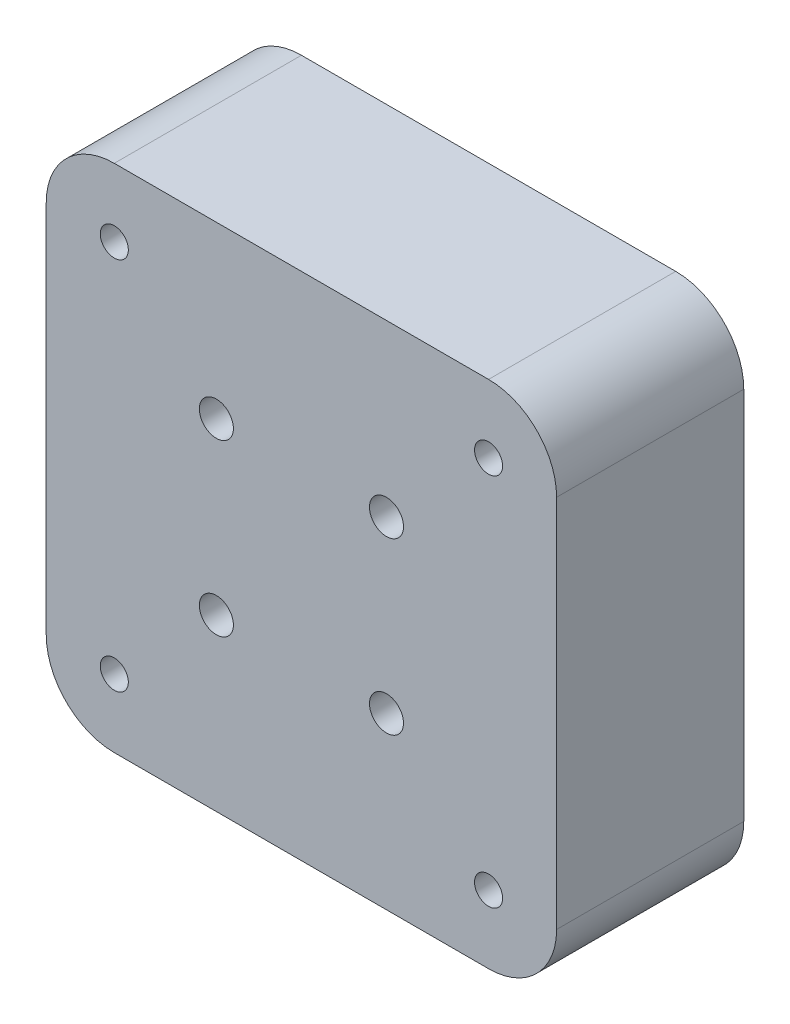
ISO-10303-21;
HEADER;
FILE_DESCRIPTION(('STEP AP214'),'2;1');
FILE_NAME('part.step','',(''),(''),'','','');
FILE_SCHEMA(('AUTOMOTIVE_DESIGN { 1 0 10303 214 1 1 1 1 }'));
ENDSEC;
DATA;
#1=APPLICATION_CONTEXT('core data for automotive mechanical design processes');
#2=APPLICATION_PROTOCOL_DEFINITION('international standard','automotive_design',2000,#1);
#3=PRODUCT_CONTEXT('',#1,'mechanical');
#4=PRODUCT('Part','Part','',(#3));
#5=PRODUCT_RELATED_PRODUCT_CATEGORY('part','',(#4));
#6=PRODUCT_DEFINITION_FORMATION('','',#4);
#7=PRODUCT_DEFINITION_CONTEXT('part definition',#1,'design');
#8=PRODUCT_DEFINITION('design','',#6,#7);
#9=PRODUCT_DEFINITION_SHAPE('','',#8);
#10=(LENGTH_UNIT() NAMED_UNIT(*) SI_UNIT(.MILLI.,.METRE.));
#11=(NAMED_UNIT(*) PLANE_ANGLE_UNIT() SI_UNIT($,.RADIAN.));
#12=(NAMED_UNIT(*) SI_UNIT($,.STERADIAN.) SOLID_ANGLE_UNIT());
#13=UNCERTAINTY_MEASURE_WITH_UNIT(LENGTH_MEASURE(1.E-05),#10,'distance_accuracy_value','');
#14=(GEOMETRIC_REPRESENTATION_CONTEXT(3) GLOBAL_UNCERTAINTY_ASSIGNED_CONTEXT((#13)) GLOBAL_UNIT_ASSIGNED_CONTEXT((#10,
#11,#12)) REPRESENTATION_CONTEXT('',''));
#15=CARTESIAN_POINT('',(0.,0.,0.));
#16=DIRECTION('',(0.,0.,1.));
#17=DIRECTION('',(1.,0.,0.));
#18=AXIS2_PLACEMENT_3D('',#15,#16,#17);
#19=CARTESIAN_POINT('',(30.,30.,22.));
#20=DIRECTION('',(-1.,0.,0.));
#21=DIRECTION('',(0.,0.,1.));
#22=AXIS2_PLACEMENT_3D('',#19,#20,#21);
#23=PLANE('',#22);
#24=DIRECTION('',(0.,1.,0.));
#25=VECTOR('',#24,1.);
#26=CARTESIAN_POINT('',(30.,30.,22.));
#27=LINE('',#26,#25);
#28=CARTESIAN_POINT('',(30.,-22.,22.));
#29=VERTEX_POINT('',#28);
#30=CARTESIAN_POINT('',(30.,22.,22.));
#31=VERTEX_POINT('',#30);
#32=EDGE_CURVE('E263',#29,#31,#27,.T.);
#33=ORIENTED_EDGE('',*,*,#32,.F.);
#34=DIRECTION('',(0.,0.,-1.));
#35=VECTOR('',#34,1.);
#36=CARTESIAN_POINT('',(30.,-22.,22.));
#37=LINE('',#36,#35);
#38=CARTESIAN_POINT('',(30.,-22.,0.));
#39=VERTEX_POINT('',#38);
#40=EDGE_CURVE('E286',#29,#39,#37,.T.);
#41=ORIENTED_EDGE('',*,*,#40,.T.);
#42=DIRECTION('',(0.,1.,0.));
#43=VECTOR('',#42,1.);
#44=CARTESIAN_POINT('',(30.,30.,0.));
#45=LINE('',#44,#43);
#46=CARTESIAN_POINT('',(30.,22.,0.));
#47=VERTEX_POINT('',#46);
#48=EDGE_CURVE('E262',#39,#47,#45,.T.);
#49=ORIENTED_EDGE('',*,*,#48,.T.);
#50=DIRECTION('',(0.,0.,-1.));
#51=VECTOR('',#50,1.);
#52=CARTESIAN_POINT('',(30.,22.,22.));
#53=LINE('',#52,#51);
#54=EDGE_CURVE('E275',#47,#31,#53,.F.);
#55=ORIENTED_EDGE('',*,*,#54,.T.);
#56=EDGE_LOOP('',(#33,#41,#49,#55));
#57=FACE_BOUND('',#56,.T.);
#58=ADVANCED_FACE('F47',(#57),#23,.F.);
#59=CARTESIAN_POINT('',(-30.,30.,22.));
#60=DIRECTION('',(0.,-1.,0.));
#61=DIRECTION('',(0.,0.,-1.));
#62=AXIS2_PLACEMENT_3D('',#59,#60,#61);
#63=PLANE('',#62);
#64=DIRECTION('',(-1.,0.,0.));
#65=VECTOR('',#64,1.);
#66=CARTESIAN_POINT('',(-30.,30.,22.));
#67=LINE('',#66,#65);
#68=CARTESIAN_POINT('',(21.9999999999999,30.,22.));
#69=VERTEX_POINT('',#68);
#70=CARTESIAN_POINT('',(-22.,30.,22.));
#71=VERTEX_POINT('',#70);
#72=EDGE_CURVE('E266',#69,#71,#67,.T.);
#73=ORIENTED_EDGE('',*,*,#72,.F.);
#74=DIRECTION('',(0.,0.,-1.));
#75=VECTOR('',#74,1.);
#76=CARTESIAN_POINT('',(22.,30.,22.));
#77=LINE('',#76,#75);
#78=CARTESIAN_POINT('',(22.,30.,0.));
#79=VERTEX_POINT('',#78);
#80=EDGE_CURVE('E13',#69,#79,#77,.T.);
#81=ORIENTED_EDGE('',*,*,#80,.T.);
#82=DIRECTION('',(-1.,0.,0.));
#83=VECTOR('',#82,1.);
#84=CARTESIAN_POINT('',(-30.,30.,0.));
#85=LINE('',#84,#83);
#86=CARTESIAN_POINT('',(-22.,30.,0.));
#87=VERTEX_POINT('',#86);
#88=EDGE_CURVE('E278',#79,#87,#85,.T.);
#89=ORIENTED_EDGE('',*,*,#88,.T.);
#90=DIRECTION('',(0.,0.,-1.));
#91=VECTOR('',#90,1.);
#92=CARTESIAN_POINT('',(-22.,30.,22.));
#93=LINE('',#92,#91);
#94=EDGE_CURVE('E56',#87,#71,#93,.F.);
#95=ORIENTED_EDGE('',*,*,#94,.T.);
#96=EDGE_LOOP('',(#73,#81,#89,#95));
#97=FACE_BOUND('',#96,.T.);
#98=ADVANCED_FACE('F380',(#97),#63,.F.);
#99=CARTESIAN_POINT('',(-30.,30.,22.));
#100=DIRECTION('',(1.,0.,0.));
#101=DIRECTION('',(0.,0.,-1.));
#102=AXIS2_PLACEMENT_3D('',#99,#100,#101);
#103=PLANE('',#102);
#104=DIRECTION('',(0.,-1.,0.));
#105=VECTOR('',#104,1.);
#106=CARTESIAN_POINT('',(-30.,30.,0.));
#107=LINE('',#106,#105);
#108=CARTESIAN_POINT('',(-30.,22.,0.));
#109=VERTEX_POINT('',#108);
#110=CARTESIAN_POINT('',(-30.,-22.,0.));
#111=VERTEX_POINT('',#110);
#112=EDGE_CURVE('E281',#109,#111,#107,.T.);
#113=ORIENTED_EDGE('',*,*,#112,.T.);
#114=DIRECTION('',(0.,0.,-1.));
#115=VECTOR('',#114,1.);
#116=CARTESIAN_POINT('',(-30.,-22.,22.));
#117=LINE('',#116,#115);
#118=CARTESIAN_POINT('',(-30.,-22.,22.));
#119=VERTEX_POINT('',#118);
#120=EDGE_CURVE('E72',#111,#119,#117,.F.);
#121=ORIENTED_EDGE('',*,*,#120,.T.);
#122=DIRECTION('',(0.,-1.,0.));
#123=VECTOR('',#122,1.);
#124=CARTESIAN_POINT('',(-30.,30.,22.));
#125=LINE('',#124,#123);
#126=CARTESIAN_POINT('',(-30.,22.,22.));
#127=VERTEX_POINT('',#126);
#128=EDGE_CURVE('E270',#127,#119,#125,.T.);
#129=ORIENTED_EDGE('',*,*,#128,.F.);
#130=DIRECTION('',(0.,0.,-1.));
#131=VECTOR('',#130,1.);
#132=CARTESIAN_POINT('',(-30.,22.,22.));
#133=LINE('',#132,#131);
#134=EDGE_CURVE('E310',#127,#109,#133,.T.);
#135=ORIENTED_EDGE('',*,*,#134,.T.);
#136=EDGE_LOOP('',(#113,#121,#129,#135));
#137=FACE_BOUND('',#136,.T.);
#138=ADVANCED_FACE('F386',(#137),#103,.F.);
#139=CARTESIAN_POINT('',(-30.,-30.,22.));
#140=DIRECTION('',(0.,1.,0.));
#141=DIRECTION('',(0.,0.,1.));
#142=AXIS2_PLACEMENT_3D('',#139,#140,#141);
#143=PLANE('',#142);
#144=DIRECTION('',(1.,0.,0.));
#145=VECTOR('',#144,1.);
#146=CARTESIAN_POINT('',(-30.,-30.,0.));
#147=LINE('',#146,#145);
#148=CARTESIAN_POINT('',(-22.,-30.,0.));
#149=VERTEX_POINT('',#148);
#150=CARTESIAN_POINT('',(22.,-30.,0.));
#151=VERTEX_POINT('',#150);
#152=EDGE_CURVE('E267',#149,#151,#147,.T.);
#153=ORIENTED_EDGE('',*,*,#152,.T.);
#154=DIRECTION('',(0.,0.,-1.));
#155=VECTOR('',#154,1.);
#156=CARTESIAN_POINT('',(22.,-30.,22.));
#157=LINE('',#156,#155);
#158=CARTESIAN_POINT('',(22.,-30.,22.));
#159=VERTEX_POINT('',#158);
#160=EDGE_CURVE('E300',#151,#159,#157,.F.);
#161=ORIENTED_EDGE('',*,*,#160,.T.);
#162=DIRECTION('',(1.,0.,0.));
#163=VECTOR('',#162,1.);
#164=CARTESIAN_POINT('',(-30.,-30.,22.));
#165=LINE('',#164,#163);
#166=CARTESIAN_POINT('',(-22.,-30.,22.));
#167=VERTEX_POINT('',#166);
#168=EDGE_CURVE('E272',#167,#159,#165,.T.);
#169=ORIENTED_EDGE('',*,*,#168,.F.);
#170=DIRECTION('',(0.,0.,-1.));
#171=VECTOR('',#170,1.);
#172=CARTESIAN_POINT('',(-22.,-30.,22.));
#173=LINE('',#172,#171);
#174=EDGE_CURVE('E297',#167,#149,#173,.T.);
#175=ORIENTED_EDGE('',*,*,#174,.T.);
#176=EDGE_LOOP('',(#153,#161,#169,#175));
#177=FACE_BOUND('',#176,.T.);
#178=ADVANCED_FACE('F342',(#177),#143,.F.);
#179=CARTESIAN_POINT('',(0.,0.,22.));
#180=DIRECTION('',(0.,0.,1.));
#181=DIRECTION('',(1.,0.,0.));
#182=AXIS2_PLACEMENT_3D('',#179,#180,#181);
#183=PLANE('',#182);
#184=CARTESIAN_POINT('',(-10.,-10.,22.));
#185=DIRECTION('',(0.,0.,1.));
#186=DIRECTION('',(1.,0.,0.));
#187=AXIS2_PLACEMENT_3D('',#184,#185,#186);
#188=CIRCLE('',#187,2.);
#189=CARTESIAN_POINT('',(-8.00000000000001,-10.,22.));
#190=VERTEX_POINT('',#189);
#191=EDGE_CURVE('E331',#190,#190,#188,.T.);
#192=ORIENTED_EDGE('',*,*,#191,.F.);
#193=EDGE_LOOP('',(#192));
#194=FACE_BOUND('',#193,.T.);
#195=CARTESIAN_POINT('',(10.,-10.,22.));
#196=DIRECTION('',(0.,0.,1.));
#197=DIRECTION('',(1.,0.,0.));
#198=AXIS2_PLACEMENT_3D('',#195,#196,#197);
#199=CIRCLE('',#198,2.);
#200=CARTESIAN_POINT('',(12.,-10.,22.));
#201=VERTEX_POINT('',#200);
#202=EDGE_CURVE('E322',#201,#201,#199,.T.);
#203=ORIENTED_EDGE('',*,*,#202,.F.);
#204=EDGE_LOOP('',(#203));
#205=FACE_BOUND('',#204,.T.);
#206=CARTESIAN_POINT('',(9.99999999999998,9.99999999999999,22.));
#207=DIRECTION('',(0.,0.,1.));
#208=DIRECTION('',(1.,0.,0.));
#209=AXIS2_PLACEMENT_3D('',#206,#207,#208);
#210=CIRCLE('',#209,2.);
#211=CARTESIAN_POINT('',(12.,9.99999999999999,22.));
#212=VERTEX_POINT('',#211);
#213=EDGE_CURVE('E319',#212,#212,#210,.T.);
#214=ORIENTED_EDGE('',*,*,#213,.F.);
#215=EDGE_LOOP('',(#214));
#216=FACE_BOUND('',#215,.T.);
#217=CARTESIAN_POINT('',(-10.,9.99999999999999,22.));
#218=DIRECTION('',(0.,0.,1.));
#219=DIRECTION('',(1.,0.,0.));
#220=AXIS2_PLACEMENT_3D('',#217,#218,#219);
#221=CIRCLE('',#220,2.);
#222=CARTESIAN_POINT('',(-8.00000000000001,9.99999999999999,22.));
#223=VERTEX_POINT('',#222);
#224=EDGE_CURVE('E191',#223,#223,#221,.T.);
#225=ORIENTED_EDGE('',*,*,#224,.F.);
#226=EDGE_LOOP('',(#225));
#227=FACE_BOUND('',#226,.T.);
#228=CARTESIAN_POINT('',(22.,22.,22.));
#229=DIRECTION('',(0.,0.,-1.));
#230=DIRECTION('',(-1.,0.,0.));
#231=AXIS2_PLACEMENT_3D('',#228,#229,#230);
#232=CIRCLE('',#231,1.65);
#233=CARTESIAN_POINT('',(20.35,22.,22.));
#234=VERTEX_POINT('',#233);
#235=EDGE_CURVE('E241',#234,#234,#232,.T.);
#236=ORIENTED_EDGE('',*,*,#235,.T.);
#237=EDGE_LOOP('',(#236));
#238=FACE_BOUND('',#237,.T.);
#239=CARTESIAN_POINT('',(-22.,22.,22.));
#240=DIRECTION('',(0.,0.,-1.));
#241=DIRECTION('',(-1.,0.,0.));
#242=AXIS2_PLACEMENT_3D('',#239,#240,#241);
#243=CIRCLE('',#242,1.65);
#244=CARTESIAN_POINT('',(-23.65,22.,22.));
#245=VERTEX_POINT('',#244);
#246=EDGE_CURVE('E247',#245,#245,#243,.T.);
#247=ORIENTED_EDGE('',*,*,#246,.T.);
#248=EDGE_LOOP('',(#247));
#249=FACE_BOUND('',#248,.T.);
#250=CARTESIAN_POINT('',(-22.,-22.,22.));
#251=DIRECTION('',(0.,0.,-1.));
#252=DIRECTION('',(-1.,0.,0.));
#253=AXIS2_PLACEMENT_3D('',#250,#251,#252);
#254=CIRCLE('',#253,1.65);
#255=CARTESIAN_POINT('',(-23.65,-22.,22.));
#256=VERTEX_POINT('',#255);
#257=EDGE_CURVE('E253',#256,#256,#254,.T.);
#258=ORIENTED_EDGE('',*,*,#257,.T.);
#259=EDGE_LOOP('',(#258));
#260=FACE_BOUND('',#259,.T.);
#261=CARTESIAN_POINT('',(22.,-22.,22.));
#262=DIRECTION('',(0.,0.,-1.));
#263=DIRECTION('',(-1.,0.,0.));
#264=AXIS2_PLACEMENT_3D('',#261,#262,#263);
#265=CIRCLE('',#264,1.65);
#266=CARTESIAN_POINT('',(20.35,-22.,22.));
#267=VERTEX_POINT('',#266);
#268=EDGE_CURVE('E259',#267,#267,#265,.T.);
#269=ORIENTED_EDGE('',*,*,#268,.T.);
#270=EDGE_LOOP('',(#269));
#271=FACE_BOUND('',#270,.T.);
#272=ORIENTED_EDGE('',*,*,#168,.T.);
#273=CARTESIAN_POINT('',(22.,-22.,22.));
#274=DIRECTION('',(0.,0.,1.));
#275=DIRECTION('',(1.,0.,0.));
#276=AXIS2_PLACEMENT_3D('',#273,#274,#275);
#277=CIRCLE('',#276,8.);
#278=EDGE_CURVE('E308',#159,#29,#277,.T.);
#279=ORIENTED_EDGE('',*,*,#278,.T.);
#280=ORIENTED_EDGE('',*,*,#32,.T.);
#281=CARTESIAN_POINT('',(22.,22.,22.));
#282=DIRECTION('',(0.,0.,1.));
#283=DIRECTION('',(1.,0.,0.));
#284=AXIS2_PLACEMENT_3D('',#281,#282,#283);
#285=CIRCLE('',#284,8.);
#286=EDGE_CURVE('E304',#31,#69,#285,.T.);
#287=ORIENTED_EDGE('',*,*,#286,.T.);
#288=ORIENTED_EDGE('',*,*,#72,.T.);
#289=CARTESIAN_POINT('',(-22.,22.,22.));
#290=DIRECTION('',(0.,0.,1.));
#291=DIRECTION('',(1.,0.,0.));
#292=AXIS2_PLACEMENT_3D('',#289,#290,#291);
#293=CIRCLE('',#292,8.);
#294=EDGE_CURVE('E302',#71,#127,#293,.T.);
#295=ORIENTED_EDGE('',*,*,#294,.T.);
#296=ORIENTED_EDGE('',*,*,#128,.T.);
#297=CARTESIAN_POINT('',(-22.,-22.,22.));
#298=DIRECTION('',(0.,0.,1.));
#299=DIRECTION('',(1.,0.,0.));
#300=AXIS2_PLACEMENT_3D('',#297,#298,#299);
#301=CIRCLE('',#300,8.);
#302=EDGE_CURVE('E306',#119,#167,#301,.T.);
#303=ORIENTED_EDGE('',*,*,#302,.T.);
#304=EDGE_LOOP('',(#272,#279,#280,#287,#288,#295,#296,#303));
#305=FACE_BOUND('',#304,.T.);
#306=ADVANCED_FACE('F338',(#194,#205,#216,#227,#238,#249,#260,#271,#305),#183,.T.);
#307=CARTESIAN_POINT('',(0.,0.,0.));
#308=DIRECTION('',(0.,0.,1.));
#309=DIRECTION('',(1.,0.,0.));
#310=AXIS2_PLACEMENT_3D('',#307,#308,#309);
#311=PLANE('',#310);
#312=DIRECTION('',(-1.,0.,0.));
#313=VECTOR('',#312,1.);
#314=CARTESIAN_POINT('',(15.,-20.,0.));
#315=LINE('',#314,#313);
#316=CARTESIAN_POINT('',(15.,-20.,0.));
#317=VERTEX_POINT('',#316);
#318=CARTESIAN_POINT('',(-15.,-20.,0.));
#319=VERTEX_POINT('',#318);
#320=EDGE_CURVE('E208',#317,#319,#315,.T.);
#321=ORIENTED_EDGE('',*,*,#320,.F.);
#322=CARTESIAN_POINT('',(15.,-15.,0.));
#323=DIRECTION('',(0.,0.,-1.));
#324=DIRECTION('',(-1.,0.,0.));
#325=AXIS2_PLACEMENT_3D('',#322,#323,#324);
#326=CIRCLE('',#325,5.);
#327=CARTESIAN_POINT('',(20.,-15.,0.));
#328=VERTEX_POINT('',#327);
#329=EDGE_CURVE('E64',#328,#317,#326,.T.);
#330=ORIENTED_EDGE('',*,*,#329,.F.);
#331=DIRECTION('',(0.,-1.,0.));
#332=VECTOR('',#331,1.);
#333=CARTESIAN_POINT('',(20.,15.,0.));
#334=LINE('',#333,#332);
#335=CARTESIAN_POINT('',(20.,15.,0.));
#336=VERTEX_POINT('',#335);
#337=EDGE_CURVE('E185',#336,#328,#334,.T.);
#338=ORIENTED_EDGE('',*,*,#337,.F.);
#339=CARTESIAN_POINT('',(15.,15.,0.));
#340=DIRECTION('',(0.,0.,-1.));
#341=DIRECTION('',(-1.,0.,0.));
#342=AXIS2_PLACEMENT_3D('',#339,#340,#341);
#343=CIRCLE('',#342,5.);
#344=CARTESIAN_POINT('',(15.,20.,0.));
#345=VERTEX_POINT('',#344);
#346=EDGE_CURVE('E188',#345,#336,#343,.T.);
#347=ORIENTED_EDGE('',*,*,#346,.F.);
#348=DIRECTION('',(1.,0.,0.));
#349=VECTOR('',#348,1.);
#350=CARTESIAN_POINT('',(15.,20.,0.));
#351=LINE('',#350,#349);
#352=CARTESIAN_POINT('',(-15.,20.,0.));
#353=VERTEX_POINT('',#352);
#354=EDGE_CURVE('E220',#353,#345,#351,.T.);
#355=ORIENTED_EDGE('',*,*,#354,.F.);
#356=CARTESIAN_POINT('',(-15.,15.,0.));
#357=DIRECTION('',(0.,0.,-1.));
#358=DIRECTION('',(-1.,0.,0.));
#359=AXIS2_PLACEMENT_3D('',#356,#357,#358);
#360=CIRCLE('',#359,5.);
#361=CARTESIAN_POINT('',(-20.,15.,0.));
#362=VERTEX_POINT('',#361);
#363=EDGE_CURVE('E217',#362,#353,#360,.T.);
#364=ORIENTED_EDGE('',*,*,#363,.F.);
#365=DIRECTION('',(0.,1.,0.));
#366=VECTOR('',#365,1.);
#367=CARTESIAN_POINT('',(-20.,15.,0.));
#368=LINE('',#367,#366);
#369=CARTESIAN_POINT('',(-20.,-15.,0.));
#370=VERTEX_POINT('',#369);
#371=EDGE_CURVE('E214',#370,#362,#368,.T.);
#372=ORIENTED_EDGE('',*,*,#371,.F.);
#373=CARTESIAN_POINT('',(-15.,-15.,0.));
#374=DIRECTION('',(0.,0.,-1.));
#375=DIRECTION('',(-1.,0.,0.));
#376=AXIS2_PLACEMENT_3D('',#373,#374,#375);
#377=CIRCLE('',#376,5.);
#378=EDGE_CURVE('E211',#319,#370,#377,.T.);
#379=ORIENTED_EDGE('',*,*,#378,.F.);
#380=EDGE_LOOP('',(#321,#330,#338,#347,#355,#364,#372,#379));
#381=FACE_BOUND('',#380,.T.);
#382=CARTESIAN_POINT('',(22.,22.,0.));
#383=DIRECTION('',(0.,0.,-1.));
#384=DIRECTION('',(-1.,0.,0.));
#385=AXIS2_PLACEMENT_3D('',#382,#383,#384);
#386=CIRCLE('',#385,1.64999999999999);
#387=CARTESIAN_POINT('',(20.35,22.,0.));
#388=VERTEX_POINT('',#387);
#389=EDGE_CURVE('E227',#388,#388,#386,.T.);
#390=ORIENTED_EDGE('',*,*,#389,.F.);
#391=EDGE_LOOP('',(#390));
#392=FACE_BOUND('',#391,.T.);
#393=CARTESIAN_POINT('',(-22.,22.,0.));
#394=DIRECTION('',(0.,0.,-1.));
#395=DIRECTION('',(-1.,0.,0.));
#396=AXIS2_PLACEMENT_3D('',#393,#394,#395);
#397=CIRCLE('',#396,1.64999999999999);
#398=CARTESIAN_POINT('',(-23.65,22.,0.));
#399=VERTEX_POINT('',#398);
#400=EDGE_CURVE('E244',#399,#399,#397,.T.);
#401=ORIENTED_EDGE('',*,*,#400,.F.);
#402=EDGE_LOOP('',(#401));
#403=FACE_BOUND('',#402,.T.);
#404=CARTESIAN_POINT('',(-22.,-22.,0.));
#405=DIRECTION('',(0.,0.,-1.));
#406=DIRECTION('',(-1.,0.,0.));
#407=AXIS2_PLACEMENT_3D('',#404,#405,#406);
#408=CIRCLE('',#407,1.64999999999999);
#409=CARTESIAN_POINT('',(-23.65,-22.,0.));
#410=VERTEX_POINT('',#409);
#411=EDGE_CURVE('E250',#410,#410,#408,.T.);
#412=ORIENTED_EDGE('',*,*,#411,.F.);
#413=EDGE_LOOP('',(#412));
#414=FACE_BOUND('',#413,.T.);
#415=CARTESIAN_POINT('',(22.,-22.,0.));
#416=DIRECTION('',(0.,0.,-1.));
#417=DIRECTION('',(-1.,0.,0.));
#418=AXIS2_PLACEMENT_3D('',#415,#416,#417);
#419=CIRCLE('',#418,1.64999999999999);
#420=CARTESIAN_POINT('',(20.35,-22.,0.));
#421=VERTEX_POINT('',#420);
#422=EDGE_CURVE('E256',#421,#421,#419,.T.);
#423=ORIENTED_EDGE('',*,*,#422,.F.);
#424=EDGE_LOOP('',(#423));
#425=FACE_BOUND('',#424,.T.);
#426=ORIENTED_EDGE('',*,*,#48,.F.);
#427=CARTESIAN_POINT('',(22.,-22.,0.));
#428=DIRECTION('',(0.,0.,1.));
#429=DIRECTION('',(1.,0.,0.));
#430=AXIS2_PLACEMENT_3D('',#427,#428,#429);
#431=CIRCLE('',#430,8.);
#432=EDGE_CURVE('E295',#39,#151,#431,.F.);
#433=ORIENTED_EDGE('',*,*,#432,.T.);
#434=ORIENTED_EDGE('',*,*,#152,.F.);
#435=CARTESIAN_POINT('',(-22.,-22.,0.));
#436=DIRECTION('',(0.,0.,1.));
#437=DIRECTION('',(1.,0.,0.));
#438=AXIS2_PLACEMENT_3D('',#435,#436,#437);
#439=CIRCLE('',#438,8.);
#440=EDGE_CURVE('E293',#149,#111,#439,.F.);
#441=ORIENTED_EDGE('',*,*,#440,.T.);
#442=ORIENTED_EDGE('',*,*,#112,.F.);
#443=CARTESIAN_POINT('',(-22.,22.,0.));
#444=DIRECTION('',(0.,0.,1.));
#445=DIRECTION('',(1.,0.,0.));
#446=AXIS2_PLACEMENT_3D('',#443,#444,#445);
#447=CIRCLE('',#446,8.);
#448=EDGE_CURVE('E289',#109,#87,#447,.F.);
#449=ORIENTED_EDGE('',*,*,#448,.T.);
#450=ORIENTED_EDGE('',*,*,#88,.F.);
#451=CARTESIAN_POINT('',(22.,22.,0.));
#452=DIRECTION('',(0.,0.,1.));
#453=DIRECTION('',(1.,0.,0.));
#454=AXIS2_PLACEMENT_3D('',#451,#452,#453);
#455=CIRCLE('',#454,8.);
#456=EDGE_CURVE('E291',#79,#47,#455,.F.);
#457=ORIENTED_EDGE('',*,*,#456,.T.);
#458=EDGE_LOOP('',(#426,#433,#434,#441,#442,#449,#450,#457));
#459=FACE_BOUND('',#458,.T.);
#460=ADVANCED_FACE('F341',(#381,#392,#403,#414,#425,#459),#311,.F.);
#461=CARTESIAN_POINT('',(22.,-22.,22.));
#462=DIRECTION('',(0.,0.,-1.));
#463=DIRECTION('',(-1.,0.,0.));
#464=AXIS2_PLACEMENT_3D('',#461,#462,#463);
#465=CYLINDRICAL_SURFACE('',#464,8.);
#466=ORIENTED_EDGE('',*,*,#278,.F.);
#467=ORIENTED_EDGE('',*,*,#160,.F.);
#468=ORIENTED_EDGE('',*,*,#432,.F.);
#469=ORIENTED_EDGE('',*,*,#40,.F.);
#470=EDGE_LOOP('',(#466,#467,#468,#469));
#471=FACE_BOUND('',#470,.T.);
#472=ADVANCED_FACE('F367',(#471),#465,.T.);
#473=CARTESIAN_POINT('',(-22.,-22.,22.));
#474=DIRECTION('',(0.,0.,-1.));
#475=DIRECTION('',(-1.,0.,0.));
#476=AXIS2_PLACEMENT_3D('',#473,#474,#475);
#477=CYLINDRICAL_SURFACE('',#476,8.);
#478=ORIENTED_EDGE('',*,*,#302,.F.);
#479=ORIENTED_EDGE('',*,*,#120,.F.);
#480=ORIENTED_EDGE('',*,*,#440,.F.);
#481=ORIENTED_EDGE('',*,*,#174,.F.);
#482=EDGE_LOOP('',(#478,#479,#480,#481));
#483=FACE_BOUND('',#482,.T.);
#484=ADVANCED_FACE('F388',(#483),#477,.T.);
#485=CARTESIAN_POINT('',(22.,22.,22.));
#486=DIRECTION('',(0.,0.,-1.));
#487=DIRECTION('',(-1.,0.,0.));
#488=AXIS2_PLACEMENT_3D('',#485,#486,#487);
#489=CYLINDRICAL_SURFACE('',#488,8.);
#490=ORIENTED_EDGE('',*,*,#286,.F.);
#491=ORIENTED_EDGE('',*,*,#54,.F.);
#492=ORIENTED_EDGE('',*,*,#456,.F.);
#493=ORIENTED_EDGE('',*,*,#80,.F.);
#494=EDGE_LOOP('',(#490,#491,#492,#493));
#495=FACE_BOUND('',#494,.T.);
#496=ADVANCED_FACE('F377',(#495),#489,.T.);
#497=CARTESIAN_POINT('',(-22.,22.,22.));
#498=DIRECTION('',(0.,0.,-1.));
#499=DIRECTION('',(-1.,0.,0.));
#500=AXIS2_PLACEMENT_3D('',#497,#498,#499);
#501=CYLINDRICAL_SURFACE('',#500,8.);
#502=ORIENTED_EDGE('',*,*,#294,.F.);
#503=ORIENTED_EDGE('',*,*,#94,.F.);
#504=ORIENTED_EDGE('',*,*,#448,.F.);
#505=ORIENTED_EDGE('',*,*,#134,.F.);
#506=EDGE_LOOP('',(#502,#503,#504,#505));
#507=FACE_BOUND('',#506,.T.);
#508=ADVANCED_FACE('F49',(#507),#501,.T.);
#509=CARTESIAN_POINT('',(22.,-22.,0.));
#510=DIRECTION('',(0.,0.,-1.));
#511=DIRECTION('',(-1.,0.,0.));
#512=AXIS2_PLACEMENT_3D('',#509,#510,#511);
#513=CYLINDRICAL_SURFACE('',#512,1.64999999999999);
#514=ORIENTED_EDGE('',*,*,#268,.F.);
#515=EDGE_LOOP('',(#514));
#516=FACE_BOUND('',#515,.T.);
#517=ORIENTED_EDGE('',*,*,#422,.T.);
#518=EDGE_LOOP('',(#517));
#519=FACE_BOUND('',#518,.T.);
#520=ADVANCED_FACE('F410',(#516,#519),#513,.F.);
#521=CARTESIAN_POINT('',(-22.,-22.,0.));
#522=DIRECTION('',(0.,0.,-1.));
#523=DIRECTION('',(-1.,0.,0.));
#524=AXIS2_PLACEMENT_3D('',#521,#522,#523);
#525=CYLINDRICAL_SURFACE('',#524,1.64999999999999);
#526=ORIENTED_EDGE('',*,*,#257,.F.);
#527=EDGE_LOOP('',(#526));
#528=FACE_BOUND('',#527,.T.);
#529=ORIENTED_EDGE('',*,*,#411,.T.);
#530=EDGE_LOOP('',(#529));
#531=FACE_BOUND('',#530,.T.);
#532=ADVANCED_FACE('F414',(#528,#531),#525,.F.);
#533=CARTESIAN_POINT('',(-22.,22.,0.));
#534=DIRECTION('',(0.,0.,-1.));
#535=DIRECTION('',(-1.,0.,0.));
#536=AXIS2_PLACEMENT_3D('',#533,#534,#535);
#537=CYLINDRICAL_SURFACE('',#536,1.64999999999999);
#538=ORIENTED_EDGE('',*,*,#246,.F.);
#539=EDGE_LOOP('',(#538));
#540=FACE_BOUND('',#539,.T.);
#541=ORIENTED_EDGE('',*,*,#400,.T.);
#542=EDGE_LOOP('',(#541));
#543=FACE_BOUND('',#542,.T.);
#544=ADVANCED_FACE('F420',(#540,#543),#537,.F.);
#545=CARTESIAN_POINT('',(22.,22.,0.));
#546=DIRECTION('',(0.,0.,-1.));
#547=DIRECTION('',(-1.,0.,0.));
#548=AXIS2_PLACEMENT_3D('',#545,#546,#547);
#549=CYLINDRICAL_SURFACE('',#548,1.64999999999999);
#550=ORIENTED_EDGE('',*,*,#235,.F.);
#551=EDGE_LOOP('',(#550));
#552=FACE_BOUND('',#551,.T.);
#553=ORIENTED_EDGE('',*,*,#389,.T.);
#554=EDGE_LOOP('',(#553));
#555=FACE_BOUND('',#554,.T.);
#556=ADVANCED_FACE('F441',(#552,#555),#549,.F.);
#557=CARTESIAN_POINT('',(15.,-15.,10.));
#558=DIRECTION('',(0.,0.,-1.));
#559=DIRECTION('',(-1.,0.,0.));
#560=AXIS2_PLACEMENT_3D('',#557,#558,#559);
#561=CYLINDRICAL_SURFACE('',#560,5.);
#562=ORIENTED_EDGE('',*,*,#329,.T.);
#563=DIRECTION('',(0.,0.,-1.));
#564=VECTOR('',#563,1.);
#565=CARTESIAN_POINT('',(15.,-20.,10.));
#566=LINE('',#565,#564);
#567=CARTESIAN_POINT('',(15.,-20.,10.));
#568=VERTEX_POINT('',#567);
#569=EDGE_CURVE('E162',#568,#317,#566,.T.);
#570=ORIENTED_EDGE('',*,*,#569,.F.);
#571=CARTESIAN_POINT('',(15.,-15.,10.));
#572=DIRECTION('',(0.,0.,-1.));
#573=DIRECTION('',(-1.,0.,0.));
#574=AXIS2_PLACEMENT_3D('',#571,#572,#573);
#575=CIRCLE('',#574,5.);
#576=CARTESIAN_POINT('',(20.,-15.,10.));
#577=VERTEX_POINT('',#576);
#578=EDGE_CURVE('E166',#577,#568,#575,.T.);
#579=ORIENTED_EDGE('',*,*,#578,.F.);
#580=DIRECTION('',(0.,0.,-1.));
#581=VECTOR('',#580,1.);
#582=CARTESIAN_POINT('',(20.,-15.,10.));
#583=LINE('',#582,#581);
#584=EDGE_CURVE('E225',#577,#328,#583,.T.);
#585=ORIENTED_EDGE('',*,*,#584,.T.);
#586=EDGE_LOOP('',(#562,#570,#579,#585));
#587=FACE_BOUND('',#586,.T.);
#588=ADVANCED_FACE('F164',(#587),#561,.F.);
#589=CARTESIAN_POINT('',(20.,15.,10.));
#590=DIRECTION('',(1.,0.,0.));
#591=DIRECTION('',(0.,1.,0.));
#592=AXIS2_PLACEMENT_3D('',#589,#590,#591);
#593=PLANE('',#592);
#594=ORIENTED_EDGE('',*,*,#337,.T.);
#595=ORIENTED_EDGE('',*,*,#584,.F.);
#596=DIRECTION('',(0.,-1.,0.));
#597=VECTOR('',#596,1.);
#598=CARTESIAN_POINT('',(20.,15.,10.));
#599=LINE('',#598,#597);
#600=CARTESIAN_POINT('',(20.,15.,10.));
#601=VERTEX_POINT('',#600);
#602=EDGE_CURVE('E172',#601,#577,#599,.T.);
#603=ORIENTED_EDGE('',*,*,#602,.F.);
#604=DIRECTION('',(0.,0.,-1.));
#605=VECTOR('',#604,1.);
#606=CARTESIAN_POINT('',(20.,15.,10.));
#607=LINE('',#606,#605);
#608=EDGE_CURVE('E228',#601,#336,#607,.T.);
#609=ORIENTED_EDGE('',*,*,#608,.T.);
#610=EDGE_LOOP('',(#594,#595,#603,#609));
#611=FACE_BOUND('',#610,.T.);
#612=ADVANCED_FACE('F451',(#611),#593,.F.);
#613=CARTESIAN_POINT('',(15.,15.,10.));
#614=DIRECTION('',(0.,0.,-1.));
#615=DIRECTION('',(-1.,0.,0.));
#616=AXIS2_PLACEMENT_3D('',#613,#614,#615);
#617=CYLINDRICAL_SURFACE('',#616,5.);
#618=ORIENTED_EDGE('',*,*,#346,.T.);
#619=ORIENTED_EDGE('',*,*,#608,.F.);
#620=CARTESIAN_POINT('',(15.,15.,10.));
#621=DIRECTION('',(0.,0.,-1.));
#622=DIRECTION('',(-1.,0.,0.));
#623=AXIS2_PLACEMENT_3D('',#620,#621,#622);
#624=CIRCLE('',#623,5.);
#625=CARTESIAN_POINT('',(15.,20.,10.));
#626=VERTEX_POINT('',#625);
#627=EDGE_CURVE('E204',#626,#601,#624,.T.);
#628=ORIENTED_EDGE('',*,*,#627,.F.);
#629=DIRECTION('',(0.,0.,-1.));
#630=VECTOR('',#629,1.);
#631=CARTESIAN_POINT('',(15.,20.,10.));
#632=LINE('',#631,#630);
#633=EDGE_CURVE('E230',#626,#345,#632,.T.);
#634=ORIENTED_EDGE('',*,*,#633,.T.);
#635=EDGE_LOOP('',(#618,#619,#628,#634));
#636=FACE_BOUND('',#635,.T.);
#637=ADVANCED_FACE('F469',(#636),#617,.F.);
#638=CARTESIAN_POINT('',(15.,20.,10.));
#639=DIRECTION('',(0.,1.,0.));
#640=DIRECTION('',(-1.,0.,0.));
#641=AXIS2_PLACEMENT_3D('',#638,#639,#640);
#642=PLANE('',#641);
#643=ORIENTED_EDGE('',*,*,#354,.T.);
#644=ORIENTED_EDGE('',*,*,#633,.F.);
#645=DIRECTION('',(1.,0.,0.));
#646=VECTOR('',#645,1.);
#647=CARTESIAN_POINT('',(15.,20.,10.));
#648=LINE('',#647,#646);
#649=CARTESIAN_POINT('',(-15.,20.,10.));
#650=VERTEX_POINT('',#649);
#651=EDGE_CURVE('E201',#650,#626,#648,.T.);
#652=ORIENTED_EDGE('',*,*,#651,.F.);
#653=DIRECTION('',(0.,0.,-1.));
#654=VECTOR('',#653,1.);
#655=CARTESIAN_POINT('',(-15.,20.,10.));
#656=LINE('',#655,#654);
#657=EDGE_CURVE('E232',#650,#353,#656,.T.);
#658=ORIENTED_EDGE('',*,*,#657,.T.);
#659=EDGE_LOOP('',(#643,#644,#652,#658));
#660=FACE_BOUND('',#659,.T.);
#661=ADVANCED_FACE('F465',(#660),#642,.F.);
#662=CARTESIAN_POINT('',(-15.,15.,10.));
#663=DIRECTION('',(0.,0.,-1.));
#664=DIRECTION('',(-1.,0.,0.));
#665=AXIS2_PLACEMENT_3D('',#662,#663,#664);
#666=CYLINDRICAL_SURFACE('',#665,5.);
#667=ORIENTED_EDGE('',*,*,#363,.T.);
#668=ORIENTED_EDGE('',*,*,#657,.F.);
#669=CARTESIAN_POINT('',(-15.,15.,10.));
#670=DIRECTION('',(0.,0.,-1.));
#671=DIRECTION('',(-1.,0.,0.));
#672=AXIS2_PLACEMENT_3D('',#669,#670,#671);
#673=CIRCLE('',#672,5.);
#674=CARTESIAN_POINT('',(-20.,15.,10.));
#675=VERTEX_POINT('',#674);
#676=EDGE_CURVE('E198',#675,#650,#673,.T.);
#677=ORIENTED_EDGE('',*,*,#676,.F.);
#678=DIRECTION('',(0.,0.,-1.));
#679=VECTOR('',#678,1.);
#680=CARTESIAN_POINT('',(-20.,15.,10.));
#681=LINE('',#680,#679);
#682=EDGE_CURVE('E234',#675,#362,#681,.T.);
#683=ORIENTED_EDGE('',*,*,#682,.T.);
#684=EDGE_LOOP('',(#667,#668,#677,#683));
#685=FACE_BOUND('',#684,.T.);
#686=ADVANCED_FACE('F461',(#685),#666,.F.);
#687=CARTESIAN_POINT('',(-20.,15.,10.));
#688=DIRECTION('',(-1.,0.,0.));
#689=DIRECTION('',(0.,0.,1.));
#690=AXIS2_PLACEMENT_3D('',#687,#688,#689);
#691=PLANE('',#690);
#692=ORIENTED_EDGE('',*,*,#371,.T.);
#693=ORIENTED_EDGE('',*,*,#682,.F.);
#694=DIRECTION('',(0.,1.,0.));
#695=VECTOR('',#694,1.);
#696=CARTESIAN_POINT('',(-20.,15.,10.));
#697=LINE('',#696,#695);
#698=CARTESIAN_POINT('',(-20.,-15.,10.));
#699=VERTEX_POINT('',#698);
#700=EDGE_CURVE('E195',#699,#675,#697,.T.);
#701=ORIENTED_EDGE('',*,*,#700,.F.);
#702=DIRECTION('',(0.,0.,-1.));
#703=VECTOR('',#702,1.);
#704=CARTESIAN_POINT('',(-20.,-15.,10.));
#705=LINE('',#704,#703);
#706=EDGE_CURVE('E236',#699,#370,#705,.T.);
#707=ORIENTED_EDGE('',*,*,#706,.T.);
#708=EDGE_LOOP('',(#692,#693,#701,#707));
#709=FACE_BOUND('',#708,.T.);
#710=ADVANCED_FACE('F457',(#709),#691,.F.);
#711=CARTESIAN_POINT('',(-15.,-15.,10.));
#712=DIRECTION('',(0.,0.,-1.));
#713=DIRECTION('',(-1.,0.,0.));
#714=AXIS2_PLACEMENT_3D('',#711,#712,#713);
#715=CYLINDRICAL_SURFACE('',#714,5.);
#716=ORIENTED_EDGE('',*,*,#378,.T.);
#717=ORIENTED_EDGE('',*,*,#706,.F.);
#718=CARTESIAN_POINT('',(-15.,-15.,10.));
#719=DIRECTION('',(0.,0.,-1.));
#720=DIRECTION('',(-1.,0.,0.));
#721=AXIS2_PLACEMENT_3D('',#718,#719,#720);
#722=CIRCLE('',#721,5.);
#723=CARTESIAN_POINT('',(-15.,-20.,10.));
#724=VERTEX_POINT('',#723);
#725=EDGE_CURVE('E180',#724,#699,#722,.T.);
#726=ORIENTED_EDGE('',*,*,#725,.F.);
#727=DIRECTION('',(0.,0.,-1.));
#728=VECTOR('',#727,1.);
#729=CARTESIAN_POINT('',(-15.,-20.,10.));
#730=LINE('',#729,#728);
#731=EDGE_CURVE('E171',#724,#319,#730,.T.);
#732=ORIENTED_EDGE('',*,*,#731,.T.);
#733=EDGE_LOOP('',(#716,#717,#726,#732));
#734=FACE_BOUND('',#733,.T.);
#735=ADVANCED_FACE('F454',(#734),#715,.F.);
#736=CARTESIAN_POINT('',(15.,-20.,10.));
#737=DIRECTION('',(0.,-1.,0.));
#738=DIRECTION('',(1.,0.,0.));
#739=AXIS2_PLACEMENT_3D('',#736,#737,#738);
#740=PLANE('',#739);
#741=ORIENTED_EDGE('',*,*,#320,.T.);
#742=ORIENTED_EDGE('',*,*,#731,.F.);
#743=DIRECTION('',(-1.,0.,0.));
#744=VECTOR('',#743,1.);
#745=CARTESIAN_POINT('',(15.,-20.,10.));
#746=LINE('',#745,#744);
#747=EDGE_CURVE('E175',#568,#724,#746,.T.);
#748=ORIENTED_EDGE('',*,*,#747,.F.);
#749=ORIENTED_EDGE('',*,*,#569,.T.);
#750=EDGE_LOOP('',(#741,#742,#748,#749));
#751=FACE_BOUND('',#750,.T.);
#752=ADVANCED_FACE('F176',(#751),#740,.F.);
#753=CARTESIAN_POINT('',(15.,-15.,10.));
#754=DIRECTION('',(0.,0.,-1.));
#755=DIRECTION('',(-1.,0.,0.));
#756=AXIS2_PLACEMENT_3D('',#753,#754,#755);
#757=PLANE('',#756);
#758=CARTESIAN_POINT('',(-9.99999999999998,-10.,10.));
#759=DIRECTION('',(0.,0.,-1.));
#760=DIRECTION('',(-1.,0.,0.));
#761=AXIS2_PLACEMENT_3D('',#758,#759,#760);
#762=CIRCLE('',#761,2.);
#763=CARTESIAN_POINT('',(-12.,-10.,10.));
#764=VERTEX_POINT('',#763);
#765=EDGE_CURVE('E51',#764,#764,#762,.T.);
#766=ORIENTED_EDGE('',*,*,#765,.F.);
#767=EDGE_LOOP('',(#766));
#768=FACE_BOUND('',#767,.T.);
#769=CARTESIAN_POINT('',(10.,-10.,10.));
#770=DIRECTION('',(0.,0.,-1.));
#771=DIRECTION('',(-1.,0.,0.));
#772=AXIS2_PLACEMENT_3D('',#769,#770,#771);
#773=CIRCLE('',#772,2.);
#774=CARTESIAN_POINT('',(8.00000000000001,-10.,10.));
#775=VERTEX_POINT('',#774);
#776=EDGE_CURVE('E320',#775,#775,#773,.T.);
#777=ORIENTED_EDGE('',*,*,#776,.F.);
#778=EDGE_LOOP('',(#777));
#779=FACE_BOUND('',#778,.T.);
#780=CARTESIAN_POINT('',(10.,9.99999999999999,10.));
#781=DIRECTION('',(0.,0.,-1.));
#782=DIRECTION('',(-1.,0.,0.));
#783=AXIS2_PLACEMENT_3D('',#780,#781,#782);
#784=CIRCLE('',#783,2.);
#785=CARTESIAN_POINT('',(8.00000000000001,9.99999999999999,10.));
#786=VERTEX_POINT('',#785);
#787=EDGE_CURVE('E317',#786,#786,#784,.T.);
#788=ORIENTED_EDGE('',*,*,#787,.F.);
#789=EDGE_LOOP('',(#788));
#790=FACE_BOUND('',#789,.T.);
#791=CARTESIAN_POINT('',(-10.,10.,10.));
#792=DIRECTION('',(0.,0.,-1.));
#793=DIRECTION('',(-1.,0.,0.));
#794=AXIS2_PLACEMENT_3D('',#791,#792,#793);
#795=CIRCLE('',#794,2.);
#796=CARTESIAN_POINT('',(-12.,10.,10.));
#797=VERTEX_POINT('',#796);
#798=EDGE_CURVE('E209',#797,#797,#795,.T.);
#799=ORIENTED_EDGE('',*,*,#798,.F.);
#800=EDGE_LOOP('',(#799));
#801=FACE_BOUND('',#800,.T.);
#802=ORIENTED_EDGE('',*,*,#578,.T.);
#803=ORIENTED_EDGE('',*,*,#747,.T.);
#804=ORIENTED_EDGE('',*,*,#725,.T.);
#805=ORIENTED_EDGE('',*,*,#700,.T.);
#806=ORIENTED_EDGE('',*,*,#676,.T.);
#807=ORIENTED_EDGE('',*,*,#651,.T.);
#808=ORIENTED_EDGE('',*,*,#627,.T.);
#809=ORIENTED_EDGE('',*,*,#602,.T.);
#810=EDGE_LOOP('',(#802,#803,#804,#805,#806,#807,#808,#809));
#811=FACE_BOUND('',#810,.T.);
#812=ADVANCED_FACE('F182',(#768,#779,#790,#801,#811),#757,.T.);
#813=CARTESIAN_POINT('',(-10.,10.,0.));
#814=DIRECTION('',(0.,0.,1.));
#815=DIRECTION('',(1.,0.,0.));
#816=AXIS2_PLACEMENT_3D('',#813,#814,#815);
#817=CYLINDRICAL_SURFACE('',#816,2.);
#818=ORIENTED_EDGE('',*,*,#798,.T.);
#819=EDGE_LOOP('',(#818));
#820=FACE_BOUND('',#819,.T.);
#821=ORIENTED_EDGE('',*,*,#224,.T.);
#822=EDGE_LOOP('',(#821));
#823=FACE_BOUND('',#822,.T.);
#824=ADVANCED_FACE('F479',(#820,#823),#817,.F.);
#825=CARTESIAN_POINT('',(10.,9.99999999999999,0.));
#826=DIRECTION('',(0.,0.,1.));
#827=DIRECTION('',(1.,0.,0.));
#828=AXIS2_PLACEMENT_3D('',#825,#826,#827);
#829=CYLINDRICAL_SURFACE('',#828,2.);
#830=ORIENTED_EDGE('',*,*,#787,.T.);
#831=EDGE_LOOP('',(#830));
#832=FACE_BOUND('',#831,.T.);
#833=ORIENTED_EDGE('',*,*,#213,.T.);
#834=EDGE_LOOP('',(#833));
#835=FACE_BOUND('',#834,.T.);
#836=ADVANCED_FACE('F483',(#832,#835),#829,.F.);
#837=CARTESIAN_POINT('',(10.,-10.,0.));
#838=DIRECTION('',(0.,0.,1.));
#839=DIRECTION('',(1.,0.,0.));
#840=AXIS2_PLACEMENT_3D('',#837,#838,#839);
#841=CYLINDRICAL_SURFACE('',#840,2.);
#842=ORIENTED_EDGE('',*,*,#776,.T.);
#843=EDGE_LOOP('',(#842));
#844=FACE_BOUND('',#843,.T.);
#845=ORIENTED_EDGE('',*,*,#202,.T.);
#846=EDGE_LOOP('',(#845));
#847=FACE_BOUND('',#846,.T.);
#848=ADVANCED_FACE('F487',(#844,#847),#841,.F.);
#849=CARTESIAN_POINT('',(-9.99999999999998,-10.,0.));
#850=DIRECTION('',(0.,0.,1.));
#851=DIRECTION('',(1.,0.,0.));
#852=AXIS2_PLACEMENT_3D('',#849,#850,#851);
#853=CYLINDRICAL_SURFACE('',#852,2.);
#854=ORIENTED_EDGE('',*,*,#765,.T.);
#855=EDGE_LOOP('',(#854));
#856=FACE_BOUND('',#855,.T.);
#857=ORIENTED_EDGE('',*,*,#191,.T.);
#858=EDGE_LOOP('',(#857));
#859=FACE_BOUND('',#858,.T.);
#860=ADVANCED_FACE('F336',(#856,#859),#853,.F.);
#861=CLOSED_SHELL('',(#58,#98,#138,#178,#306,#460,#472,#484,#496,#508,#520,#532,#544,#556,#588,
#612,#637,#661,#686,#710,#735,#752,#812,#824,#836,#848,#860));
#862=MANIFOLD_SOLID_BREP('B2',#861);
#863=ADVANCED_BREP_SHAPE_REPRESENTATION('',(#18,#862),#14);
#864=SHAPE_DEFINITION_REPRESENTATION(#9,#863);
ENDSEC;
END-ISO-10303-21;
